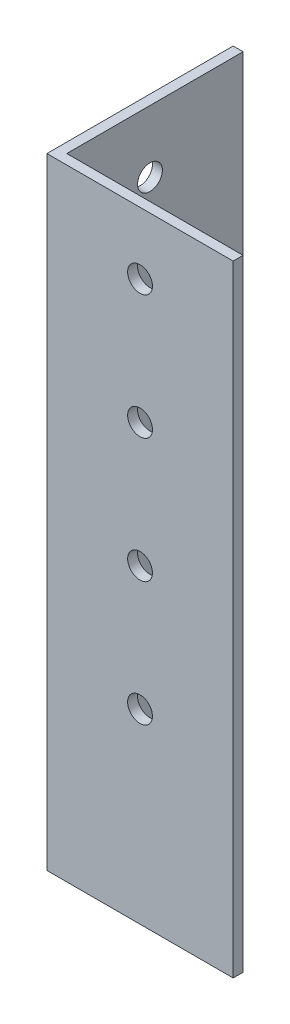
ISO-10303-21;
HEADER;
FILE_DESCRIPTION(('STEP AP214'),'2;1');
FILE_NAME('part.step','',(''),(''),'','','');
FILE_SCHEMA(('AUTOMOTIVE_DESIGN { 1 0 10303 214 1 1 1 1 }'));
ENDSEC;
DATA;
#1=APPLICATION_CONTEXT('core data for automotive mechanical design processes');
#2=APPLICATION_PROTOCOL_DEFINITION('international standard','automotive_design',2000,#1);
#3=PRODUCT_CONTEXT('',#1,'mechanical');
#4=PRODUCT('Part','Part','',(#3));
#5=PRODUCT_RELATED_PRODUCT_CATEGORY('part','',(#4));
#6=PRODUCT_DEFINITION_FORMATION('','',#4);
#7=PRODUCT_DEFINITION_CONTEXT('part definition',#1,'design');
#8=PRODUCT_DEFINITION('design','',#6,#7);
#9=PRODUCT_DEFINITION_SHAPE('','',#8);
#10=(LENGTH_UNIT() NAMED_UNIT(*) SI_UNIT(.MILLI.,.METRE.));
#11=(NAMED_UNIT(*) PLANE_ANGLE_UNIT() SI_UNIT($,.RADIAN.));
#12=(NAMED_UNIT(*) SI_UNIT($,.STERADIAN.) SOLID_ANGLE_UNIT());
#13=UNCERTAINTY_MEASURE_WITH_UNIT(LENGTH_MEASURE(1.E-05),#10,'distance_accuracy_value','');
#14=(GEOMETRIC_REPRESENTATION_CONTEXT(3) GLOBAL_UNCERTAINTY_ASSIGNED_CONTEXT((#13)) GLOBAL_UNIT_ASSIGNED_CONTEXT((#10,
#11,#12)) REPRESENTATION_CONTEXT('',''));
#15=CARTESIAN_POINT('',(0.,0.,0.));
#16=DIRECTION('',(0.,0.,1.));
#17=DIRECTION('',(1.,0.,0.));
#18=AXIS2_PLACEMENT_3D('',#15,#16,#17);
#19=CARTESIAN_POINT('',(4.,250.,0.));
#20=DIRECTION('',(-1.,0.,0.));
#21=DIRECTION('',(0.,0.,1.));
#22=AXIS2_PLACEMENT_3D('',#19,#20,#21);
#23=PLANE('',#22);
#24=CARTESIAN_POINT('',(4.,175.,-37.4999999999995));
#25=DIRECTION('',(-1.,0.,0.));
#26=DIRECTION('',(0.,0.,1.));
#27=AXIS2_PLACEMENT_3D('',#24,#25,#26);
#28=CIRCLE('',#27,5.);
#29=CARTESIAN_POINT('',(4.,175.,-32.4999999999995));
#30=VERTEX_POINT('',#29);
#31=EDGE_CURVE('E188',#30,#30,#28,.T.);
#32=ORIENTED_EDGE('',*,*,#31,.T.);
#33=EDGE_LOOP('',(#32));
#34=FACE_BOUND('',#33,.T.);
#35=CARTESIAN_POINT('',(4.,125.,-37.4999999999989));
#36=DIRECTION('',(-1.,0.,0.));
#37=DIRECTION('',(0.,0.,1.));
#38=AXIS2_PLACEMENT_3D('',#35,#36,#37);
#39=CIRCLE('',#38,5.);
#40=CARTESIAN_POINT('',(4.,125.,-32.499999999999));
#41=VERTEX_POINT('',#40);
#42=EDGE_CURVE('E192',#41,#41,#39,.T.);
#43=ORIENTED_EDGE('',*,*,#42,.T.);
#44=EDGE_LOOP('',(#43));
#45=FACE_BOUND('',#44,.T.);
#46=CARTESIAN_POINT('',(4.,75.,-37.4999999999984));
#47=DIRECTION('',(-1.,0.,0.));
#48=DIRECTION('',(0.,0.,1.));
#49=AXIS2_PLACEMENT_3D('',#46,#47,#48);
#50=CIRCLE('',#49,5.);
#51=CARTESIAN_POINT('',(4.,75.,-32.4999999999984));
#52=VERTEX_POINT('',#51);
#53=EDGE_CURVE('E196',#52,#52,#50,.T.);
#54=ORIENTED_EDGE('',*,*,#53,.T.);
#55=EDGE_LOOP('',(#54));
#56=FACE_BOUND('',#55,.T.);
#57=CARTESIAN_POINT('',(4.,225.,-37.5));
#58=DIRECTION('',(-1.,0.,0.));
#59=DIRECTION('',(0.,0.,1.));
#60=AXIS2_PLACEMENT_3D('',#57,#58,#59);
#61=CIRCLE('',#60,5.);
#62=CARTESIAN_POINT('',(4.,225.,-32.5));
#63=VERTEX_POINT('',#62);
#64=EDGE_CURVE('E199',#63,#63,#61,.T.);
#65=ORIENTED_EDGE('',*,*,#64,.T.);
#66=EDGE_LOOP('',(#65));
#67=FACE_BOUND('',#66,.T.);
#68=DIRECTION('',(0.,0.,-1.));
#69=VECTOR('',#68,1.);
#70=CARTESIAN_POINT('',(4.,0.,0.));
#71=LINE('',#70,#69);
#72=CARTESIAN_POINT('',(4.,0.,-4.));
#73=VERTEX_POINT('',#72);
#74=CARTESIAN_POINT('',(4.,0.,-75.));
#75=VERTEX_POINT('',#74);
#76=EDGE_CURVE('E118',#73,#75,#71,.T.);
#77=ORIENTED_EDGE('',*,*,#76,.T.);
#78=DIRECTION('',(0.,-1.,0.));
#79=VECTOR('',#78,1.);
#80=CARTESIAN_POINT('',(4.,250.,-75.));
#81=LINE('',#80,#79);
#82=CARTESIAN_POINT('',(4.,250.,-75.));
#83=VERTEX_POINT('',#82);
#84=EDGE_CURVE('E11',#83,#75,#81,.T.);
#85=ORIENTED_EDGE('',*,*,#84,.F.);
#86=DIRECTION('',(0.,0.,-1.));
#87=VECTOR('',#86,1.);
#88=CARTESIAN_POINT('',(4.,250.,0.));
#89=LINE('',#88,#87);
#90=CARTESIAN_POINT('',(4.,250.,-4.));
#91=VERTEX_POINT('',#90);
#92=EDGE_CURVE('E83',#91,#83,#89,.T.);
#93=ORIENTED_EDGE('',*,*,#92,.F.);
#94=DIRECTION('',(0.,-1.,0.));
#95=VECTOR('',#94,1.);
#96=CARTESIAN_POINT('',(4.,250.,-4.));
#97=LINE('',#96,#95);
#98=EDGE_CURVE('E114',#91,#73,#97,.T.);
#99=ORIENTED_EDGE('',*,*,#98,.T.);
#100=EDGE_LOOP('',(#77,#85,#93,#99));
#101=FACE_BOUND('',#100,.T.);
#102=ADVANCED_FACE('F35',(#34,#45,#56,#67,#101),#23,.F.);
#103=CARTESIAN_POINT('',(0.,250.,-75.));
#104=DIRECTION('',(0.,0.,-1.));
#105=DIRECTION('',(-1.,0.,0.));
#106=AXIS2_PLACEMENT_3D('',#103,#104,#105);
#107=PLANE('',#106);
#108=DIRECTION('',(1.,0.,0.));
#109=VECTOR('',#108,1.);
#110=CARTESIAN_POINT('',(0.,0.,-75.));
#111=LINE('',#110,#109);
#112=CARTESIAN_POINT('',(0.,0.,-75.));
#113=VERTEX_POINT('',#112);
#114=EDGE_CURVE('E121',#113,#75,#111,.T.);
#115=ORIENTED_EDGE('',*,*,#114,.F.);
#116=DIRECTION('',(0.,-1.,0.));
#117=VECTOR('',#116,1.);
#118=CARTESIAN_POINT('',(0.,250.,-75.));
#119=LINE('',#118,#117);
#120=CARTESIAN_POINT('',(0.,250.,-75.));
#121=VERTEX_POINT('',#120);
#122=EDGE_CURVE('E44',#121,#113,#119,.T.);
#123=ORIENTED_EDGE('',*,*,#122,.F.);
#124=DIRECTION('',(1.,0.,0.));
#125=VECTOR('',#124,1.);
#126=CARTESIAN_POINT('',(0.,250.,-75.));
#127=LINE('',#126,#125);
#128=EDGE_CURVE('E158',#121,#83,#127,.T.);
#129=ORIENTED_EDGE('',*,*,#128,.T.);
#130=ORIENTED_EDGE('',*,*,#84,.T.);
#131=EDGE_LOOP('',(#115,#123,#129,#130));
#132=FACE_BOUND('',#131,.T.);
#133=ADVANCED_FACE('F179',(#132),#107,.T.);
#134=CARTESIAN_POINT('',(0.,250.,0.));
#135=DIRECTION('',(-1.,0.,0.));
#136=DIRECTION('',(0.,0.,1.));
#137=AXIS2_PLACEMENT_3D('',#134,#135,#136);
#138=PLANE('',#137);
#139=CARTESIAN_POINT('',(0.,175.,-37.4999999999995));
#140=DIRECTION('',(-1.,0.,0.));
#141=DIRECTION('',(0.,0.,1.));
#142=AXIS2_PLACEMENT_3D('',#139,#140,#141);
#143=CIRCLE('',#142,5.);
#144=CARTESIAN_POINT('',(0.,175.,-32.4999999999995));
#145=VERTEX_POINT('',#144);
#146=EDGE_CURVE('E265',#145,#145,#143,.T.);
#147=ORIENTED_EDGE('',*,*,#146,.F.);
#148=EDGE_LOOP('',(#147));
#149=FACE_BOUND('',#148,.T.);
#150=CARTESIAN_POINT('',(0.,125.,-37.4999999999989));
#151=DIRECTION('',(-1.,0.,0.));
#152=DIRECTION('',(0.,0.,1.));
#153=AXIS2_PLACEMENT_3D('',#150,#151,#152);
#154=CIRCLE('',#153,5.);
#155=CARTESIAN_POINT('',(0.,125.,-32.499999999999));
#156=VERTEX_POINT('',#155);
#157=EDGE_CURVE('E272',#156,#156,#154,.T.);
#158=ORIENTED_EDGE('',*,*,#157,.F.);
#159=EDGE_LOOP('',(#158));
#160=FACE_BOUND('',#159,.T.);
#161=CARTESIAN_POINT('',(0.,75.,-37.4999999999984));
#162=DIRECTION('',(-1.,0.,0.));
#163=DIRECTION('',(0.,0.,1.));
#164=AXIS2_PLACEMENT_3D('',#161,#162,#163);
#165=CIRCLE('',#164,5.);
#166=CARTESIAN_POINT('',(0.,75.,-32.4999999999984));
#167=VERTEX_POINT('',#166);
#168=EDGE_CURVE('E269',#167,#167,#165,.T.);
#169=ORIENTED_EDGE('',*,*,#168,.F.);
#170=EDGE_LOOP('',(#169));
#171=FACE_BOUND('',#170,.T.);
#172=CARTESIAN_POINT('',(0.,225.,-37.5));
#173=DIRECTION('',(-1.,0.,0.));
#174=DIRECTION('',(0.,0.,1.));
#175=AXIS2_PLACEMENT_3D('',#172,#173,#174);
#176=CIRCLE('',#175,5.);
#177=CARTESIAN_POINT('',(0.,225.,-32.5));
#178=VERTEX_POINT('',#177);
#179=EDGE_CURVE('E201',#178,#178,#176,.T.);
#180=ORIENTED_EDGE('',*,*,#179,.F.);
#181=EDGE_LOOP('',(#180));
#182=FACE_BOUND('',#181,.T.);
#183=DIRECTION('',(0.,0.,-1.));
#184=VECTOR('',#183,1.);
#185=CARTESIAN_POINT('',(0.,0.,0.));
#186=LINE('',#185,#184);
#187=CARTESIAN_POINT('',(0.,0.,0.));
#188=VERTEX_POINT('',#187);
#189=EDGE_CURVE('E125',#188,#113,#186,.T.);
#190=ORIENTED_EDGE('',*,*,#189,.F.);
#191=DIRECTION('',(0.,-1.,0.));
#192=VECTOR('',#191,1.);
#193=CARTESIAN_POINT('',(0.,250.,0.));
#194=LINE('',#193,#192);
#195=CARTESIAN_POINT('',(0.,250.,0.));
#196=VERTEX_POINT('',#195);
#197=EDGE_CURVE('E104',#196,#188,#194,.T.);
#198=ORIENTED_EDGE('',*,*,#197,.F.);
#199=DIRECTION('',(0.,0.,-1.));
#200=VECTOR('',#199,1.);
#201=CARTESIAN_POINT('',(0.,250.,0.));
#202=LINE('',#201,#200);
#203=EDGE_CURVE('E110',#196,#121,#202,.T.);
#204=ORIENTED_EDGE('',*,*,#203,.T.);
#205=ORIENTED_EDGE('',*,*,#122,.T.);
#206=EDGE_LOOP('',(#190,#198,#204,#205));
#207=FACE_BOUND('',#206,.T.);
#208=ADVANCED_FACE('F162',(#149,#160,#171,#182,#207),#138,.T.);
#209=CARTESIAN_POINT('',(0.,250.,0.));
#210=DIRECTION('',(0.,0.,1.));
#211=DIRECTION('',(1.,0.,0.));
#212=AXIS2_PLACEMENT_3D('',#209,#210,#211);
#213=PLANE('',#212);
#214=CARTESIAN_POINT('',(37.5000000000005,175.,0.));
#215=DIRECTION('',(0.,0.,1.));
#216=DIRECTION('',(1.,0.,0.));
#217=AXIS2_PLACEMENT_3D('',#214,#215,#216);
#218=CIRCLE('',#217,5.00000000000001);
#219=CARTESIAN_POINT('',(42.5000000000005,175.,0.));
#220=VERTEX_POINT('',#219);
#221=EDGE_CURVE('E142',#220,#220,#218,.T.);
#222=ORIENTED_EDGE('',*,*,#221,.F.);
#223=EDGE_LOOP('',(#222));
#224=FACE_BOUND('',#223,.T.);
#225=CARTESIAN_POINT('',(37.500000000001,125.,0.));
#226=DIRECTION('',(0.,0.,1.));
#227=DIRECTION('',(1.,0.,0.));
#228=AXIS2_PLACEMENT_3D('',#225,#226,#227);
#229=CIRCLE('',#228,5.);
#230=CARTESIAN_POINT('',(42.500000000001,125.,0.));
#231=VERTEX_POINT('',#230);
#232=EDGE_CURVE('E204',#231,#231,#229,.T.);
#233=ORIENTED_EDGE('',*,*,#232,.F.);
#234=EDGE_LOOP('',(#233));
#235=FACE_BOUND('',#234,.T.);
#236=CARTESIAN_POINT('',(37.5000000000016,75.0000000000001,0.));
#237=DIRECTION('',(0.,0.,1.));
#238=DIRECTION('',(1.,0.,0.));
#239=AXIS2_PLACEMENT_3D('',#236,#237,#238);
#240=CIRCLE('',#239,5.);
#241=CARTESIAN_POINT('',(42.5000000000016,75.0000000000001,0.));
#242=VERTEX_POINT('',#241);
#243=EDGE_CURVE('E155',#242,#242,#240,.T.);
#244=ORIENTED_EDGE('',*,*,#243,.F.);
#245=EDGE_LOOP('',(#244));
#246=FACE_BOUND('',#245,.T.);
#247=CARTESIAN_POINT('',(37.5,225.,0.));
#248=DIRECTION('',(0.,0.,1.));
#249=DIRECTION('',(1.,0.,0.));
#250=AXIS2_PLACEMENT_3D('',#247,#248,#249);
#251=CIRCLE('',#250,5.);
#252=CARTESIAN_POINT('',(42.5,225.,0.));
#253=VERTEX_POINT('',#252);
#254=EDGE_CURVE('E138',#253,#253,#251,.T.);
#255=ORIENTED_EDGE('',*,*,#254,.F.);
#256=EDGE_LOOP('',(#255));
#257=FACE_BOUND('',#256,.T.);
#258=DIRECTION('',(-1.,0.,0.));
#259=VECTOR('',#258,1.);
#260=CARTESIAN_POINT('',(0.,0.,0.));
#261=LINE('',#260,#259);
#262=CARTESIAN_POINT('',(75.,0.,0.));
#263=VERTEX_POINT('',#262);
#264=EDGE_CURVE('E99',#263,#188,#261,.T.);
#265=ORIENTED_EDGE('',*,*,#264,.F.);
#266=DIRECTION('',(0.,-1.,0.));
#267=VECTOR('',#266,1.);
#268=CARTESIAN_POINT('',(75.,250.,0.));
#269=LINE('',#268,#267);
#270=CARTESIAN_POINT('',(75.,250.,0.));
#271=VERTEX_POINT('',#270);
#272=EDGE_CURVE('E94',#271,#263,#269,.T.);
#273=ORIENTED_EDGE('',*,*,#272,.F.);
#274=DIRECTION('',(-1.,0.,0.));
#275=VECTOR('',#274,1.);
#276=CARTESIAN_POINT('',(0.,250.,0.));
#277=LINE('',#276,#275);
#278=EDGE_CURVE('E97',#271,#196,#277,.T.);
#279=ORIENTED_EDGE('',*,*,#278,.T.);
#280=ORIENTED_EDGE('',*,*,#197,.T.);
#281=EDGE_LOOP('',(#265,#273,#279,#280));
#282=FACE_BOUND('',#281,.T.);
#283=ADVANCED_FACE('F96',(#224,#235,#246,#257,#282),#213,.T.);
#284=CARTESIAN_POINT('',(75.,250.,-4.));
#285=DIRECTION('',(1.,0.,0.));
#286=DIRECTION('',(0.,0.,-1.));
#287=AXIS2_PLACEMENT_3D('',#284,#285,#286);
#288=PLANE('',#287);
#289=DIRECTION('',(0.,0.,1.));
#290=VECTOR('',#289,1.);
#291=CARTESIAN_POINT('',(75.,0.,-4.));
#292=LINE('',#291,#290);
#293=CARTESIAN_POINT('',(75.,0.,-4.));
#294=VERTEX_POINT('',#293);
#295=EDGE_CURVE('E129',#294,#263,#292,.T.);
#296=ORIENTED_EDGE('',*,*,#295,.F.);
#297=DIRECTION('',(0.,-1.,0.));
#298=VECTOR('',#297,1.);
#299=CARTESIAN_POINT('',(75.,250.,-4.));
#300=LINE('',#299,#298);
#301=CARTESIAN_POINT('',(75.,250.,-4.));
#302=VERTEX_POINT('',#301);
#303=EDGE_CURVE('E74',#302,#294,#300,.T.);
#304=ORIENTED_EDGE('',*,*,#303,.F.);
#305=DIRECTION('',(0.,0.,1.));
#306=VECTOR('',#305,1.);
#307=CARTESIAN_POINT('',(75.,250.,-4.));
#308=LINE('',#307,#306);
#309=EDGE_CURVE('E108',#302,#271,#308,.T.);
#310=ORIENTED_EDGE('',*,*,#309,.T.);
#311=ORIENTED_EDGE('',*,*,#272,.T.);
#312=EDGE_LOOP('',(#296,#304,#310,#311));
#313=FACE_BOUND('',#312,.T.);
#314=ADVANCED_FACE('F112',(#313),#288,.T.);
#315=CARTESIAN_POINT('',(0.,250.,-4.));
#316=DIRECTION('',(0.,0.,1.));
#317=DIRECTION('',(1.,0.,0.));
#318=AXIS2_PLACEMENT_3D('',#315,#316,#317);
#319=PLANE('',#318);
#320=CARTESIAN_POINT('',(37.5000000000005,175.,-4.));
#321=DIRECTION('',(0.,0.,1.));
#322=DIRECTION('',(1.,0.,0.));
#323=AXIS2_PLACEMENT_3D('',#320,#321,#322);
#324=CIRCLE('',#323,5.00000000000001);
#325=CARTESIAN_POINT('',(42.5000000000005,175.,-4.));
#326=VERTEX_POINT('',#325);
#327=EDGE_CURVE('E38',#326,#326,#324,.T.);
#328=ORIENTED_EDGE('',*,*,#327,.T.);
#329=EDGE_LOOP('',(#328));
#330=FACE_BOUND('',#329,.T.);
#331=CARTESIAN_POINT('',(37.500000000001,125.,-4.));
#332=DIRECTION('',(0.,0.,1.));
#333=DIRECTION('',(1.,0.,0.));
#334=AXIS2_PLACEMENT_3D('',#331,#332,#333);
#335=CIRCLE('',#334,5.);
#336=CARTESIAN_POINT('',(42.500000000001,125.,-4.));
#337=VERTEX_POINT('',#336);
#338=EDGE_CURVE('E141',#337,#337,#335,.T.);
#339=ORIENTED_EDGE('',*,*,#338,.T.);
#340=EDGE_LOOP('',(#339));
#341=FACE_BOUND('',#340,.T.);
#342=CARTESIAN_POINT('',(37.5000000000016,75.0000000000001,-4.));
#343=DIRECTION('',(0.,0.,1.));
#344=DIRECTION('',(1.,0.,0.));
#345=AXIS2_PLACEMENT_3D('',#342,#343,#344);
#346=CIRCLE('',#345,5.);
#347=CARTESIAN_POINT('',(42.5000000000016,75.0000000000001,-4.));
#348=VERTEX_POINT('',#347);
#349=EDGE_CURVE('E139',#348,#348,#346,.T.);
#350=ORIENTED_EDGE('',*,*,#349,.T.);
#351=EDGE_LOOP('',(#350));
#352=FACE_BOUND('',#351,.T.);
#353=CARTESIAN_POINT('',(37.5,225.,-4.));
#354=DIRECTION('',(0.,0.,1.));
#355=DIRECTION('',(1.,0.,0.));
#356=AXIS2_PLACEMENT_3D('',#353,#354,#355);
#357=CIRCLE('',#356,5.);
#358=CARTESIAN_POINT('',(42.5,225.,-4.));
#359=VERTEX_POINT('',#358);
#360=EDGE_CURVE('E122',#359,#359,#357,.T.);
#361=ORIENTED_EDGE('',*,*,#360,.T.);
#362=EDGE_LOOP('',(#361));
#363=FACE_BOUND('',#362,.T.);
#364=DIRECTION('',(1.,0.,0.));
#365=VECTOR('',#364,1.);
#366=CARTESIAN_POINT('',(0.,0.,-4.));
#367=LINE('',#366,#365);
#368=EDGE_CURVE('E77',#294,#73,#367,.F.);
#369=ORIENTED_EDGE('',*,*,#368,.T.);
#370=ORIENTED_EDGE('',*,*,#98,.F.);
#371=DIRECTION('',(1.,0.,0.));
#372=VECTOR('',#371,1.);
#373=CARTESIAN_POINT('',(0.,250.,-4.));
#374=LINE('',#373,#372);
#375=EDGE_CURVE('E53',#302,#91,#374,.F.);
#376=ORIENTED_EDGE('',*,*,#375,.F.);
#377=ORIENTED_EDGE('',*,*,#303,.T.);
#378=EDGE_LOOP('',(#369,#370,#376,#377));
#379=FACE_BOUND('',#378,.T.);
#380=ADVANCED_FACE('F168',(#330,#341,#352,#363,#379),#319,.F.);
#381=CARTESIAN_POINT('',(0.,250.,0.));
#382=DIRECTION('',(0.,-1.,0.));
#383=DIRECTION('',(-1.,0.,0.));
#384=AXIS2_PLACEMENT_3D('',#381,#382,#383);
#385=PLANE('',#384);
#386=ORIENTED_EDGE('',*,*,#92,.T.);
#387=ORIENTED_EDGE('',*,*,#128,.F.);
#388=ORIENTED_EDGE('',*,*,#203,.F.);
#389=ORIENTED_EDGE('',*,*,#278,.F.);
#390=ORIENTED_EDGE('',*,*,#309,.F.);
#391=ORIENTED_EDGE('',*,*,#375,.T.);
#392=EDGE_LOOP('',(#386,#387,#388,#389,#390,#391));
#393=FACE_BOUND('',#392,.T.);
#394=ADVANCED_FACE('F107',(#393),#385,.F.);
#395=CARTESIAN_POINT('',(0.,0.,0.));
#396=DIRECTION('',(0.,-1.,0.));
#397=DIRECTION('',(-1.,0.,0.));
#398=AXIS2_PLACEMENT_3D('',#395,#396,#397);
#399=PLANE('',#398);
#400=ORIENTED_EDGE('',*,*,#76,.F.);
#401=ORIENTED_EDGE('',*,*,#368,.F.);
#402=ORIENTED_EDGE('',*,*,#295,.T.);
#403=ORIENTED_EDGE('',*,*,#264,.T.);
#404=ORIENTED_EDGE('',*,*,#189,.T.);
#405=ORIENTED_EDGE('',*,*,#114,.T.);
#406=EDGE_LOOP('',(#400,#401,#402,#403,#404,#405));
#407=FACE_BOUND('',#406,.T.);
#408=ADVANCED_FACE('F166',(#407),#399,.T.);
#409=CARTESIAN_POINT('',(37.5,225.,-10.));
#410=DIRECTION('',(0.,0.,1.));
#411=DIRECTION('',(1.,0.,0.));
#412=AXIS2_PLACEMENT_3D('',#409,#410,#411);
#413=CYLINDRICAL_SURFACE('',#412,5.);
#414=ORIENTED_EDGE('',*,*,#254,.T.);
#415=EDGE_LOOP('',(#414));
#416=FACE_BOUND('',#415,.T.);
#417=ORIENTED_EDGE('',*,*,#360,.F.);
#418=EDGE_LOOP('',(#417));
#419=FACE_BOUND('',#418,.T.);
#420=ADVANCED_FACE('F226',(#416,#419),#413,.F.);
#421=CARTESIAN_POINT('',(37.5000000000016,75.0000000000001,-10.));
#422=DIRECTION('',(0.,0.,1.));
#423=DIRECTION('',(1.,0.,0.));
#424=AXIS2_PLACEMENT_3D('',#421,#422,#423);
#425=CYLINDRICAL_SURFACE('',#424,5.);
#426=ORIENTED_EDGE('',*,*,#243,.T.);
#427=EDGE_LOOP('',(#426));
#428=FACE_BOUND('',#427,.T.);
#429=ORIENTED_EDGE('',*,*,#349,.F.);
#430=EDGE_LOOP('',(#429));
#431=FACE_BOUND('',#430,.T.);
#432=ADVANCED_FACE('F223',(#428,#431),#425,.F.);
#433=CARTESIAN_POINT('',(37.500000000001,125.,-10.));
#434=DIRECTION('',(0.,0.,1.));
#435=DIRECTION('',(1.,0.,0.));
#436=AXIS2_PLACEMENT_3D('',#433,#434,#435);
#437=CYLINDRICAL_SURFACE('',#436,5.);
#438=ORIENTED_EDGE('',*,*,#232,.T.);
#439=EDGE_LOOP('',(#438));
#440=FACE_BOUND('',#439,.T.);
#441=ORIENTED_EDGE('',*,*,#338,.F.);
#442=EDGE_LOOP('',(#441));
#443=FACE_BOUND('',#442,.T.);
#444=ADVANCED_FACE('F213',(#440,#443),#437,.F.);
#445=CARTESIAN_POINT('',(37.5000000000005,175.,-10.));
#446=DIRECTION('',(0.,0.,1.));
#447=DIRECTION('',(1.,0.,0.));
#448=AXIS2_PLACEMENT_3D('',#445,#446,#447);
#449=CYLINDRICAL_SURFACE('',#448,5.00000000000001);
#450=ORIENTED_EDGE('',*,*,#221,.T.);
#451=EDGE_LOOP('',(#450));
#452=FACE_BOUND('',#451,.T.);
#453=ORIENTED_EDGE('',*,*,#327,.F.);
#454=EDGE_LOOP('',(#453));
#455=FACE_BOUND('',#454,.T.);
#456=ADVANCED_FACE('F241',(#452,#455),#449,.F.);
#457=CARTESIAN_POINT('',(10.,225.,-37.5));
#458=DIRECTION('',(-1.,0.,0.));
#459=DIRECTION('',(0.,0.,1.));
#460=AXIS2_PLACEMENT_3D('',#457,#458,#459);
#461=CYLINDRICAL_SURFACE('',#460,5.);
#462=ORIENTED_EDGE('',*,*,#179,.T.);
#463=EDGE_LOOP('',(#462));
#464=FACE_BOUND('',#463,.T.);
#465=ORIENTED_EDGE('',*,*,#64,.F.);
#466=EDGE_LOOP('',(#465));
#467=FACE_BOUND('',#466,.T.);
#468=ADVANCED_FACE('F244',(#464,#467),#461,.F.);
#469=CARTESIAN_POINT('',(10.,75.,-37.4999999999984));
#470=DIRECTION('',(-1.,0.,0.));
#471=DIRECTION('',(0.,0.,1.));
#472=AXIS2_PLACEMENT_3D('',#469,#470,#471);
#473=CYLINDRICAL_SURFACE('',#472,5.);
#474=ORIENTED_EDGE('',*,*,#168,.T.);
#475=EDGE_LOOP('',(#474));
#476=FACE_BOUND('',#475,.T.);
#477=ORIENTED_EDGE('',*,*,#53,.F.);
#478=EDGE_LOOP('',(#477));
#479=FACE_BOUND('',#478,.T.);
#480=ADVANCED_FACE('F248',(#476,#479),#473,.F.);
#481=CARTESIAN_POINT('',(10.,125.,-37.4999999999989));
#482=DIRECTION('',(-1.,0.,0.));
#483=DIRECTION('',(0.,0.,1.));
#484=AXIS2_PLACEMENT_3D('',#481,#482,#483);
#485=CYLINDRICAL_SURFACE('',#484,5.);
#486=ORIENTED_EDGE('',*,*,#157,.T.);
#487=EDGE_LOOP('',(#486));
#488=FACE_BOUND('',#487,.T.);
#489=ORIENTED_EDGE('',*,*,#42,.F.);
#490=EDGE_LOOP('',(#489));
#491=FACE_BOUND('',#490,.T.);
#492=ADVANCED_FACE('F252',(#488,#491),#485,.F.);
#493=CARTESIAN_POINT('',(10.,175.,-37.4999999999995));
#494=DIRECTION('',(-1.,0.,0.));
#495=DIRECTION('',(0.,0.,1.));
#496=AXIS2_PLACEMENT_3D('',#493,#494,#495);
#497=CYLINDRICAL_SURFACE('',#496,5.);
#498=ORIENTED_EDGE('',*,*,#146,.T.);
#499=EDGE_LOOP('',(#498));
#500=FACE_BOUND('',#499,.T.);
#501=ORIENTED_EDGE('',*,*,#31,.F.);
#502=EDGE_LOOP('',(#501));
#503=FACE_BOUND('',#502,.T.);
#504=ADVANCED_FACE('F256',(#500,#503),#497,.F.);
#505=CLOSED_SHELL('',(#102,#133,#208,#283,#314,#380,#394,#408,#420,#432,#444,#456,#468,#480,
#492,#504));
#506=MANIFOLD_SOLID_BREP('B2',#505);
#507=ADVANCED_BREP_SHAPE_REPRESENTATION('',(#18,#506),#14);
#508=SHAPE_DEFINITION_REPRESENTATION(#9,#507);
ENDSEC;
END-ISO-10303-21;
